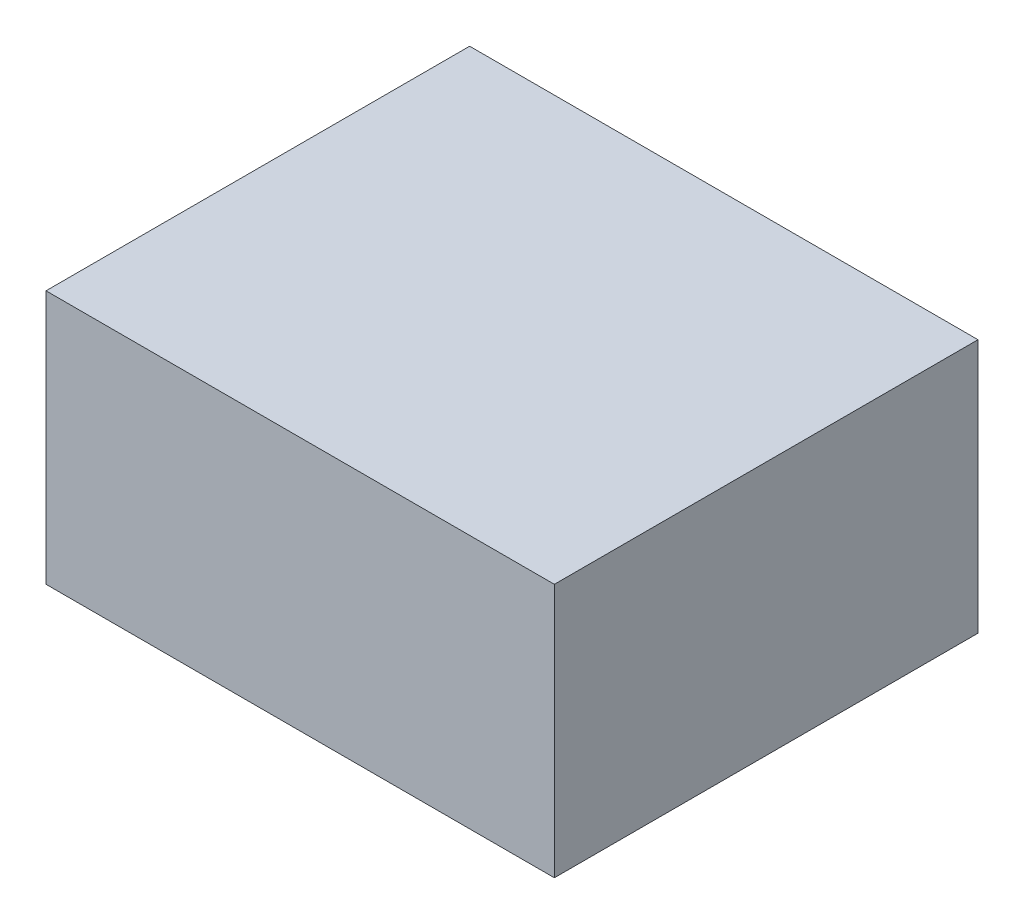
ISO-10303-21;
HEADER;
FILE_DESCRIPTION(('STEP AP214'),'2;1');
FILE_NAME('part.step','',(''),(''),'','','');
FILE_SCHEMA(('AUTOMOTIVE_DESIGN { 1 0 10303 214 1 1 1 1 }'));
ENDSEC;
DATA;
#1=APPLICATION_CONTEXT('core data for automotive mechanical design processes');
#2=APPLICATION_PROTOCOL_DEFINITION('international standard','automotive_design',2000,#1);
#3=PRODUCT_CONTEXT('',#1,'mechanical');
#4=PRODUCT('Part','Part','',(#3));
#5=PRODUCT_RELATED_PRODUCT_CATEGORY('part','',(#4));
#6=PRODUCT_DEFINITION_FORMATION('','',#4);
#7=PRODUCT_DEFINITION_CONTEXT('part definition',#1,'design');
#8=PRODUCT_DEFINITION('design','',#6,#7);
#9=PRODUCT_DEFINITION_SHAPE('','',#8);
#10=(LENGTH_UNIT() NAMED_UNIT(*) SI_UNIT(.MILLI.,.METRE.));
#11=(NAMED_UNIT(*) PLANE_ANGLE_UNIT() SI_UNIT($,.RADIAN.));
#12=(NAMED_UNIT(*) SI_UNIT($,.STERADIAN.) SOLID_ANGLE_UNIT());
#13=UNCERTAINTY_MEASURE_WITH_UNIT(LENGTH_MEASURE(1.E-05),#10,'distance_accuracy_value','');
#14=(GEOMETRIC_REPRESENTATION_CONTEXT(3) GLOBAL_UNCERTAINTY_ASSIGNED_CONTEXT((#13)) GLOBAL_UNIT_ASSIGNED_CONTEXT((#10,
#11,#12)) REPRESENTATION_CONTEXT('',''));
#15=CARTESIAN_POINT('',(0.,0.,0.));
#16=DIRECTION('',(0.,0.,1.));
#17=DIRECTION('',(1.,0.,0.));
#18=AXIS2_PLACEMENT_3D('',#15,#16,#17);
#19=CARTESIAN_POINT('',(0.,18.,-30.));
#20=DIRECTION('',(0.,0.,-1.));
#21=DIRECTION('',(-1.,0.,0.));
#22=AXIS2_PLACEMENT_3D('',#19,#20,#21);
#23=PLANE('',#22);
#24=DIRECTION('',(1.,0.,0.));
#25=VECTOR('',#24,1.);
#26=CARTESIAN_POINT('',(0.,0.,-30.));
#27=LINE('',#26,#25);
#28=CARTESIAN_POINT('',(0.,0.,-30.));
#29=VERTEX_POINT('',#28);
#30=CARTESIAN_POINT('',(36.,0.,-30.));
#31=VERTEX_POINT('',#30);
#32=EDGE_CURVE('E104',#29,#31,#27,.T.);
#33=ORIENTED_EDGE('',*,*,#32,.F.);
#34=DIRECTION('',(0.,-1.,0.));
#35=VECTOR('',#34,1.);
#36=CARTESIAN_POINT('',(0.,18.,-30.));
#37=LINE('',#36,#35);
#38=CARTESIAN_POINT('',(0.,18.,-30.));
#39=VERTEX_POINT('',#38);
#40=EDGE_CURVE('E11',#39,#29,#37,.T.);
#41=ORIENTED_EDGE('',*,*,#40,.F.);
#42=DIRECTION('',(1.,0.,0.));
#43=VECTOR('',#42,1.);
#44=CARTESIAN_POINT('',(0.,18.,-30.));
#45=LINE('',#44,#43);
#46=CARTESIAN_POINT('',(36.,18.,-30.));
#47=VERTEX_POINT('',#46);
#48=EDGE_CURVE('E98',#39,#47,#45,.T.);
#49=ORIENTED_EDGE('',*,*,#48,.T.);
#50=DIRECTION('',(0.,-1.,0.));
#51=VECTOR('',#50,1.);
#52=CARTESIAN_POINT('',(36.,18.,-30.));
#53=LINE('',#52,#51);
#54=EDGE_CURVE('E43',#47,#31,#53,.T.);
#55=ORIENTED_EDGE('',*,*,#54,.T.);
#56=EDGE_LOOP('',(#33,#41,#49,#55));
#57=FACE_BOUND('',#56,.T.);
#58=ADVANCED_FACE('F40',(#57),#23,.T.);
#59=CARTESIAN_POINT('',(0.,18.,0.));
#60=DIRECTION('',(-1.,0.,0.));
#61=DIRECTION('',(0.,0.,1.));
#62=AXIS2_PLACEMENT_3D('',#59,#60,#61);
#63=PLANE('',#62);
#64=DIRECTION('',(0.,0.,-1.));
#65=VECTOR('',#64,1.);
#66=CARTESIAN_POINT('',(0.,0.,0.));
#67=LINE('',#66,#65);
#68=CARTESIAN_POINT('',(0.,0.,0.));
#69=VERTEX_POINT('',#68);
#70=EDGE_CURVE('E100',#69,#29,#67,.T.);
#71=ORIENTED_EDGE('',*,*,#70,.F.);
#72=DIRECTION('',(0.,-1.,0.));
#73=VECTOR('',#72,1.);
#74=CARTESIAN_POINT('',(0.,18.,0.));
#75=LINE('',#74,#73);
#76=CARTESIAN_POINT('',(0.,18.,0.));
#77=VERTEX_POINT('',#76);
#78=EDGE_CURVE('E49',#77,#69,#75,.T.);
#79=ORIENTED_EDGE('',*,*,#78,.F.);
#80=DIRECTION('',(0.,0.,-1.));
#81=VECTOR('',#80,1.);
#82=CARTESIAN_POINT('',(0.,18.,0.));
#83=LINE('',#82,#81);
#84=EDGE_CURVE('E88',#77,#39,#83,.T.);
#85=ORIENTED_EDGE('',*,*,#84,.T.);
#86=ORIENTED_EDGE('',*,*,#40,.T.);
#87=EDGE_LOOP('',(#71,#79,#85,#86));
#88=FACE_BOUND('',#87,.T.);
#89=ADVANCED_FACE('F114',(#88),#63,.T.);
#90=CARTESIAN_POINT('',(0.,18.,0.));
#91=DIRECTION('',(0.,0.,-1.));
#92=DIRECTION('',(-1.,0.,0.));
#93=AXIS2_PLACEMENT_3D('',#90,#91,#92);
#94=PLANE('',#93);
#95=DIRECTION('',(1.,0.,0.));
#96=VECTOR('',#95,1.);
#97=CARTESIAN_POINT('',(0.,0.,0.));
#98=LINE('',#97,#96);
#99=CARTESIAN_POINT('',(36.,0.,0.));
#100=VERTEX_POINT('',#99);
#101=EDGE_CURVE('E93',#69,#100,#98,.T.);
#102=ORIENTED_EDGE('',*,*,#101,.T.);
#103=DIRECTION('',(0.,-1.,0.));
#104=VECTOR('',#103,1.);
#105=CARTESIAN_POINT('',(36.,18.,0.));
#106=LINE('',#105,#104);
#107=CARTESIAN_POINT('',(36.,18.,0.));
#108=VERTEX_POINT('',#107);
#109=EDGE_CURVE('E91',#108,#100,#106,.T.);
#110=ORIENTED_EDGE('',*,*,#109,.F.);
#111=DIRECTION('',(1.,0.,0.));
#112=VECTOR('',#111,1.);
#113=CARTESIAN_POINT('',(0.,18.,0.));
#114=LINE('',#113,#112);
#115=EDGE_CURVE('E85',#77,#108,#114,.T.);
#116=ORIENTED_EDGE('',*,*,#115,.F.);
#117=ORIENTED_EDGE('',*,*,#78,.T.);
#118=EDGE_LOOP('',(#102,#110,#116,#117));
#119=FACE_BOUND('',#118,.T.);
#120=ADVANCED_FACE('F92',(#119),#94,.F.);
#121=CARTESIAN_POINT('',(36.,18.,0.));
#122=DIRECTION('',(-1.,0.,0.));
#123=DIRECTION('',(0.,0.,1.));
#124=AXIS2_PLACEMENT_3D('',#121,#122,#123);
#125=PLANE('',#124);
#126=DIRECTION('',(0.,0.,-1.));
#127=VECTOR('',#126,1.);
#128=CARTESIAN_POINT('',(36.,0.,0.));
#129=LINE('',#128,#127);
#130=EDGE_CURVE('E107',#100,#31,#129,.T.);
#131=ORIENTED_EDGE('',*,*,#130,.T.);
#132=ORIENTED_EDGE('',*,*,#54,.F.);
#133=DIRECTION('',(0.,0.,-1.));
#134=VECTOR('',#133,1.);
#135=CARTESIAN_POINT('',(36.,18.,0.));
#136=LINE('',#135,#134);
#137=EDGE_CURVE('E82',#108,#47,#136,.T.);
#138=ORIENTED_EDGE('',*,*,#137,.F.);
#139=ORIENTED_EDGE('',*,*,#109,.T.);
#140=EDGE_LOOP('',(#131,#132,#138,#139));
#141=FACE_BOUND('',#140,.T.);
#142=ADVANCED_FACE('F97',(#141),#125,.F.);
#143=CARTESIAN_POINT('',(0.,18.,0.));
#144=DIRECTION('',(0.,1.,0.));
#145=DIRECTION('',(0.,0.,1.));
#146=AXIS2_PLACEMENT_3D('',#143,#144,#145);
#147=PLANE('',#146);
#148=ORIENTED_EDGE('',*,*,#48,.F.);
#149=ORIENTED_EDGE('',*,*,#84,.F.);
#150=ORIENTED_EDGE('',*,*,#115,.T.);
#151=ORIENTED_EDGE('',*,*,#137,.T.);
#152=EDGE_LOOP('',(#148,#149,#150,#151));
#153=FACE_BOUND('',#152,.T.);
#154=ADVANCED_FACE('F87',(#153),#147,.T.);
#155=CARTESIAN_POINT('',(0.,0.,0.));
#156=DIRECTION('',(0.,1.,0.));
#157=DIRECTION('',(0.,0.,1.));
#158=AXIS2_PLACEMENT_3D('',#155,#156,#157);
#159=PLANE('',#158);
#160=ORIENTED_EDGE('',*,*,#32,.T.);
#161=ORIENTED_EDGE('',*,*,#130,.F.);
#162=ORIENTED_EDGE('',*,*,#101,.F.);
#163=ORIENTED_EDGE('',*,*,#70,.T.);
#164=EDGE_LOOP('',(#160,#161,#162,#163));
#165=FACE_BOUND('',#164,.T.);
#166=ADVANCED_FACE('F113',(#165),#159,.F.);
#167=CLOSED_SHELL('',(#58,#89,#120,#142,#154,#166));
#168=MANIFOLD_SOLID_BREP('B2',#167);
#169=ADVANCED_BREP_SHAPE_REPRESENTATION('',(#18,#168),#14);
#170=SHAPE_DEFINITION_REPRESENTATION(#9,#169);
ENDSEC;
END-ISO-10303-21;
